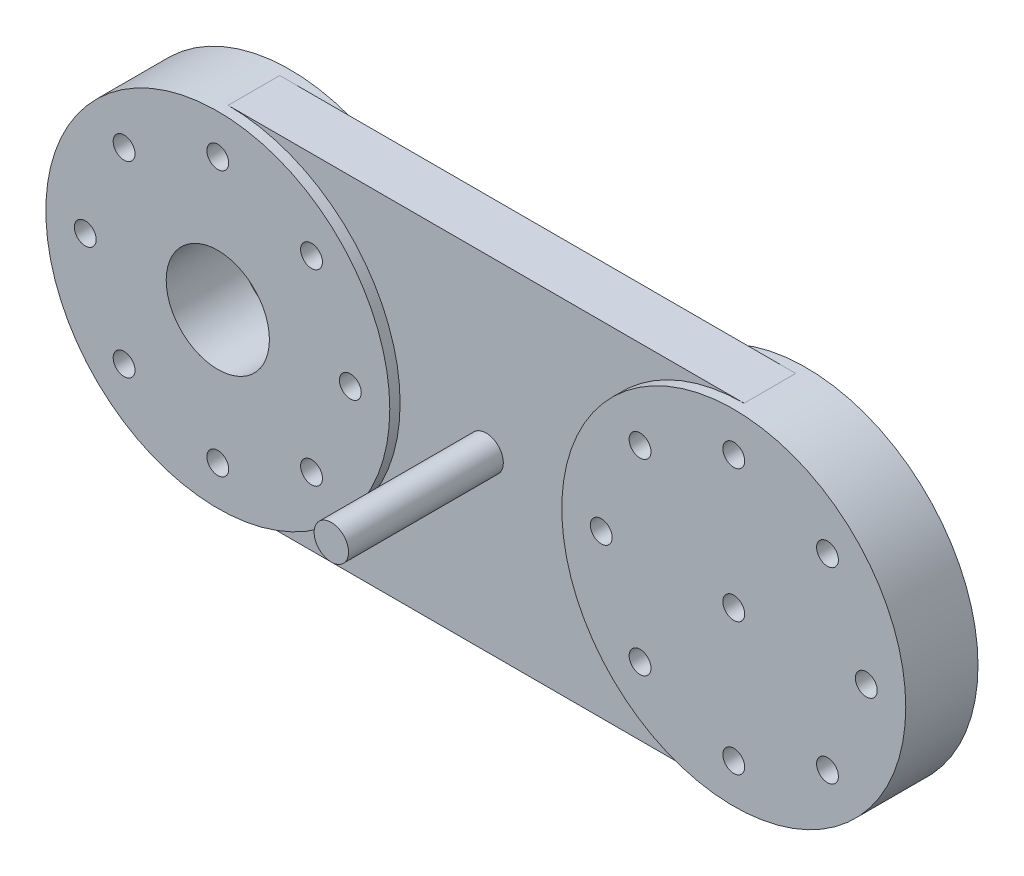
ISO-10303-21;
HEADER;
FILE_DESCRIPTION(('STEP AP214'),'2;1');
FILE_NAME('part.step','',(''),(''),'','','');
FILE_SCHEMA(('AUTOMOTIVE_DESIGN { 1 0 10303 214 1 1 1 1 }'));
ENDSEC;
DATA;
#1=APPLICATION_CONTEXT('core data for automotive mechanical design processes');
#2=APPLICATION_PROTOCOL_DEFINITION('international standard','automotive_design',2000,#1);
#3=PRODUCT_CONTEXT('',#1,'mechanical');
#4=PRODUCT('Part','Part','',(#3));
#5=PRODUCT_RELATED_PRODUCT_CATEGORY('part','',(#4));
#6=PRODUCT_DEFINITION_FORMATION('','',#4);
#7=PRODUCT_DEFINITION_CONTEXT('part definition',#1,'design');
#8=PRODUCT_DEFINITION('design','',#6,#7);
#9=PRODUCT_DEFINITION_SHAPE('','',#8);
#10=(LENGTH_UNIT() NAMED_UNIT(*) SI_UNIT(.MILLI.,.METRE.));
#11=(NAMED_UNIT(*) PLANE_ANGLE_UNIT() SI_UNIT($,.RADIAN.));
#12=(NAMED_UNIT(*) SI_UNIT($,.STERADIAN.) SOLID_ANGLE_UNIT());
#13=UNCERTAINTY_MEASURE_WITH_UNIT(LENGTH_MEASURE(1.E-05),#10,'distance_accuracy_value','');
#14=(GEOMETRIC_REPRESENTATION_CONTEXT(3) GLOBAL_UNCERTAINTY_ASSIGNED_CONTEXT((#13)) GLOBAL_UNIT_ASSIGNED_CONTEXT((#10,
#11,#12)) REPRESENTATION_CONTEXT('',''));
#15=CARTESIAN_POINT('',(0.,0.,0.));
#16=DIRECTION('',(0.,0.,1.));
#17=DIRECTION('',(1.,0.,0.));
#18=AXIS2_PLACEMENT_3D('',#15,#16,#17);
#19=CARTESIAN_POINT('',(0.,0.,-15.));
#20=DIRECTION('',(0.,1.,0.));
#21=DIRECTION('',(-1.,0.,0.));
#22=AXIS2_PLACEMENT_3D('',#19,#20,#21);
#23=PLANE('',#22);
#24=DIRECTION('',(-1.,0.,0.));
#25=VECTOR('',#24,1.);
#26=CARTESIAN_POINT('',(0.,0.,0.));
#27=LINE('',#26,#25);
#28=CARTESIAN_POINT('',(0.,0.,0.));
#29=VERTEX_POINT('',#28);
#30=CARTESIAN_POINT('',(-150.,0.,0.));
#31=VERTEX_POINT('',#30);
#32=EDGE_CURVE('E71',#29,#31,#27,.T.);
#33=ORIENTED_EDGE('',*,*,#32,.T.);
#34=DIRECTION('',(0.,0.,1.));
#35=VECTOR('',#34,1.);
#36=CARTESIAN_POINT('',(-150.,0.,-15.));
#37=LINE('',#36,#35);
#38=CARTESIAN_POINT('',(-150.,0.,-15.));
#39=VERTEX_POINT('',#38);
#40=EDGE_CURVE('E86',#39,#31,#37,.T.);
#41=ORIENTED_EDGE('',*,*,#40,.F.);
#42=DIRECTION('',(-1.,0.,0.));
#43=VECTOR('',#42,1.);
#44=CARTESIAN_POINT('',(0.,0.,-15.));
#45=LINE('',#44,#43);
#46=CARTESIAN_POINT('',(0.,0.,-15.));
#47=VERTEX_POINT('',#46);
#48=EDGE_CURVE('E83',#47,#39,#45,.T.);
#49=ORIENTED_EDGE('',*,*,#48,.F.);
#50=DIRECTION('',(0.,0.,1.));
#51=VECTOR('',#50,1.);
#52=CARTESIAN_POINT('',(0.,0.,-15.));
#53=LINE('',#52,#51);
#54=EDGE_CURVE('E44',#47,#29,#53,.T.);
#55=ORIENTED_EDGE('',*,*,#54,.T.);
#56=EDGE_LOOP('',(#33,#41,#49,#55));
#57=FACE_BOUND('',#56,.T.);
#58=ADVANCED_FACE('F36',(#57),#23,.F.);
#59=CARTESIAN_POINT('',(0.,100.,-15.));
#60=DIRECTION('',(0.,1.,0.));
#61=DIRECTION('',(-1.,0.,0.));
#62=AXIS2_PLACEMENT_3D('',#59,#60,#61);
#63=PLANE('',#62);
#64=DIRECTION('',(-1.,0.,0.));
#65=VECTOR('',#64,1.);
#66=CARTESIAN_POINT('',(0.,100.,0.));
#67=LINE('',#66,#65);
#68=CARTESIAN_POINT('',(0.,100.,0.));
#69=VERTEX_POINT('',#68);
#70=CARTESIAN_POINT('',(-150.,100.,0.));
#71=VERTEX_POINT('',#70);
#72=EDGE_CURVE('E79',#69,#71,#67,.T.);
#73=ORIENTED_EDGE('',*,*,#72,.F.);
#74=DIRECTION('',(0.,0.,1.));
#75=VECTOR('',#74,1.);
#76=CARTESIAN_POINT('',(0.,100.,-15.));
#77=LINE('',#76,#75);
#78=CARTESIAN_POINT('',(0.,100.,-15.));
#79=VERTEX_POINT('',#78);
#80=EDGE_CURVE('E90',#79,#69,#77,.T.);
#81=ORIENTED_EDGE('',*,*,#80,.F.);
#82=DIRECTION('',(-1.,0.,0.));
#83=VECTOR('',#82,1.);
#84=CARTESIAN_POINT('',(0.,100.,-15.));
#85=LINE('',#84,#83);
#86=CARTESIAN_POINT('',(-150.,100.,-15.));
#87=VERTEX_POINT('',#86);
#88=EDGE_CURVE('E78',#79,#87,#85,.T.);
#89=ORIENTED_EDGE('',*,*,#88,.T.);
#90=DIRECTION('',(0.,0.,1.));
#91=VECTOR('',#90,1.);
#92=CARTESIAN_POINT('',(-150.,100.,-15.));
#93=LINE('',#92,#91);
#94=EDGE_CURVE('E108',#87,#71,#93,.T.);
#95=ORIENTED_EDGE('',*,*,#94,.T.);
#96=EDGE_LOOP('',(#73,#81,#89,#95));
#97=FACE_BOUND('',#96,.T.);
#98=ADVANCED_FACE('F38',(#97),#63,.T.);
#99=CARTESIAN_POINT('',(0.,0.,-15.));
#100=DIRECTION('',(0.,0.,1.));
#101=DIRECTION('',(1.,0.,0.));
#102=AXIS2_PLACEMENT_3D('',#99,#100,#101);
#103=PLANE('',#102);
#104=ORIENTED_EDGE('',*,*,#48,.T.);
#105=CARTESIAN_POINT('',(-150.,50.,-15.));
#106=DIRECTION('',(0.,0.,1.));
#107=DIRECTION('',(1.,0.,0.));
#108=AXIS2_PLACEMENT_3D('',#105,#106,#107);
#109=CIRCLE('',#108,50.);
#110=EDGE_CURVE('E92',#39,#87,#109,.T.);
#111=ORIENTED_EDGE('',*,*,#110,.T.);
#112=ORIENTED_EDGE('',*,*,#88,.F.);
#113=CARTESIAN_POINT('',(0.,50.,-15.));
#114=DIRECTION('',(0.,0.,1.));
#115=DIRECTION('',(1.,0.,0.));
#116=AXIS2_PLACEMENT_3D('',#113,#114,#115);
#117=CIRCLE('',#116,50.);
#118=EDGE_CURVE('E97',#79,#47,#117,.T.);
#119=ORIENTED_EDGE('',*,*,#118,.T.);
#120=EDGE_LOOP('',(#104,#111,#112,#119));
#121=FACE_BOUND('',#120,.T.);
#122=ADVANCED_FACE('F117',(#121),#103,.F.);
#123=CARTESIAN_POINT('',(0.,0.,0.));
#124=DIRECTION('',(0.,0.,1.));
#125=DIRECTION('',(1.,0.,0.));
#126=AXIS2_PLACEMENT_3D('',#123,#124,#125);
#127=PLANE('',#126);
#128=CARTESIAN_POINT('',(-150.,50.,0.));
#129=DIRECTION('',(0.,0.,1.));
#130=DIRECTION('',(1.,0.,0.));
#131=AXIS2_PLACEMENT_3D('',#128,#129,#130);
#132=CIRCLE('',#131,50.);
#133=EDGE_CURVE('E11',#31,#71,#132,.T.);
#134=ORIENTED_EDGE('',*,*,#133,.F.);
#135=ORIENTED_EDGE('',*,*,#32,.F.);
#136=CARTESIAN_POINT('',(0.,50.,0.));
#137=DIRECTION('',(0.,0.,1.));
#138=DIRECTION('',(1.,0.,0.));
#139=AXIS2_PLACEMENT_3D('',#136,#137,#138);
#140=CIRCLE('',#139,50.);
#141=EDGE_CURVE('E54',#69,#29,#140,.T.);
#142=ORIENTED_EDGE('',*,*,#141,.F.);
#143=ORIENTED_EDGE('',*,*,#72,.T.);
#144=EDGE_LOOP('',(#134,#135,#142,#143));
#145=FACE_BOUND('',#144,.T.);
#146=CARTESIAN_POINT('',(-75.,50.,0.));
#147=DIRECTION('',(0.,0.,1.));
#148=DIRECTION('',(1.,0.,0.));
#149=AXIS2_PLACEMENT_3D('',#146,#147,#148);
#150=CIRCLE('',#149,5.00000000000001);
#151=CARTESIAN_POINT('',(-70.,50.,0.));
#152=VERTEX_POINT('',#151);
#153=EDGE_CURVE('E91',#152,#152,#150,.T.);
#154=ORIENTED_EDGE('',*,*,#153,.F.);
#155=EDGE_LOOP('',(#154));
#156=FACE_BOUND('',#155,.T.);
#157=ADVANCED_FACE('F73',(#145,#156),#127,.T.);
#158=CARTESIAN_POINT('',(-75.,50.,45.));
#159=DIRECTION('',(0.,0.,-1.));
#160=DIRECTION('',(-1.,0.,0.));
#161=AXIS2_PLACEMENT_3D('',#158,#159,#160);
#162=CYLINDRICAL_SURFACE('',#161,5.00000000000001);
#163=CARTESIAN_POINT('',(-75.,50.,45.));
#164=DIRECTION('',(0.,0.,1.));
#165=DIRECTION('',(1.,0.,0.));
#166=AXIS2_PLACEMENT_3D('',#163,#164,#165);
#167=CIRCLE('',#166,5.00000000000001);
#168=CARTESIAN_POINT('',(-70.,50.,45.));
#169=VERTEX_POINT('',#168);
#170=EDGE_CURVE('E95',#169,#169,#167,.T.);
#171=ORIENTED_EDGE('',*,*,#170,.F.);
#172=EDGE_LOOP('',(#171));
#173=FACE_BOUND('',#172,.T.);
#174=ORIENTED_EDGE('',*,*,#153,.T.);
#175=EDGE_LOOP('',(#174));
#176=FACE_BOUND('',#175,.T.);
#177=ADVANCED_FACE('F287',(#173,#176),#162,.T.);
#178=CARTESIAN_POINT('',(-75.,50.,45.));
#179=DIRECTION('',(0.,0.,1.));
#180=DIRECTION('',(1.,0.,0.));
#181=AXIS2_PLACEMENT_3D('',#178,#179,#180);
#182=PLANE('',#181);
#183=ORIENTED_EDGE('',*,*,#170,.T.);
#184=EDGE_LOOP('',(#183));
#185=FACE_BOUND('',#184,.T.);
#186=ADVANCED_FACE('F292',(#185),#182,.T.);
#187=CARTESIAN_POINT('',(-150.,50.,3.));
#188=DIRECTION('',(0.,0.,-1.));
#189=DIRECTION('',(-1.,0.,0.));
#190=AXIS2_PLACEMENT_3D('',#187,#188,#189);
#191=CYLINDRICAL_SURFACE('',#190,50.);
#192=CARTESIAN_POINT('',(-150.,50.,3.));
#193=DIRECTION('',(0.,0.,1.));
#194=DIRECTION('',(1.,0.,0.));
#195=AXIS2_PLACEMENT_3D('',#192,#193,#194);
#196=CIRCLE('',#195,50.);
#197=CARTESIAN_POINT('',(-100.,50.,3.));
#198=VERTEX_POINT('',#197);
#199=EDGE_CURVE('E143',#198,#198,#196,.T.);
#200=ORIENTED_EDGE('',*,*,#199,.F.);
#201=EDGE_LOOP('',(#200));
#202=FACE_BOUND('',#201,.T.);
#203=CARTESIAN_POINT('',(-150.,50.,-17.9999999999999));
#204=DIRECTION('',(0.,0.,1.));
#205=DIRECTION('',(1.,0.,0.));
#206=AXIS2_PLACEMENT_3D('',#203,#204,#205);
#207=CIRCLE('',#206,50.);
#208=CARTESIAN_POINT('',(-100.,50.,-17.9999999999999));
#209=VERTEX_POINT('',#208);
#210=EDGE_CURVE('E170',#209,#209,#207,.T.);
#211=ORIENTED_EDGE('',*,*,#210,.T.);
#212=EDGE_LOOP('',(#211));
#213=FACE_BOUND('',#212,.T.);
#214=ORIENTED_EDGE('',*,*,#94,.F.);
#215=ORIENTED_EDGE('',*,*,#110,.F.);
#216=ORIENTED_EDGE('',*,*,#40,.T.);
#217=ORIENTED_EDGE('',*,*,#133,.T.);
#218=EDGE_LOOP('',(#214,#215,#216,#217));
#219=FACE_BOUND('',#218,.T.);
#220=ADVANCED_FACE('F115',(#202,#213,#219),#191,.T.);
#221=CARTESIAN_POINT('',(-122.754935969732,22.7549359697323,3.));
#222=DIRECTION('',(0.,0.,-1.));
#223=DIRECTION('',(-1.,0.,0.));
#224=AXIS2_PLACEMENT_3D('',#221,#222,#223);
#225=CYLINDRICAL_SURFACE('',#224,3.175);
#226=CARTESIAN_POINT('',(-122.754935969732,22.7549359697323,3.));
#227=DIRECTION('',(0.,0.,1.));
#228=DIRECTION('',(1.,0.,0.));
#229=AXIS2_PLACEMENT_3D('',#226,#227,#228);
#230=CIRCLE('',#229,3.175);
#231=CARTESIAN_POINT('',(-119.579935969732,22.7549359697323,3.));
#232=VERTEX_POINT('',#231);
#233=EDGE_CURVE('E120',#232,#232,#230,.T.);
#234=ORIENTED_EDGE('',*,*,#233,.T.);
#235=EDGE_LOOP('',(#234));
#236=FACE_BOUND('',#235,.T.);
#237=CARTESIAN_POINT('',(-122.754935969732,22.7549359697323,-17.9999999999999));
#238=DIRECTION('',(0.,0.,1.));
#239=DIRECTION('',(1.,0.,0.));
#240=AXIS2_PLACEMENT_3D('',#237,#238,#239);
#241=CIRCLE('',#240,3.175);
#242=CARTESIAN_POINT('',(-119.579935969732,22.7549359697323,-17.9999999999999));
#243=VERTEX_POINT('',#242);
#244=EDGE_CURVE('E149',#243,#243,#241,.T.);
#245=ORIENTED_EDGE('',*,*,#244,.F.);
#246=EDGE_LOOP('',(#245));
#247=FACE_BOUND('',#246,.T.);
#248=ADVANCED_FACE('F298',(#236,#247),#225,.F.);
#249=CARTESIAN_POINT('',(-122.754935969734,77.2450640302665,3.));
#250=DIRECTION('',(0.,0.,-1.));
#251=DIRECTION('',(-1.,0.,0.));
#252=AXIS2_PLACEMENT_3D('',#249,#250,#251);
#253=CYLINDRICAL_SURFACE('',#252,3.175);
#254=CARTESIAN_POINT('',(-122.754935969734,77.2450640302665,3.));
#255=DIRECTION('',(0.,0.,1.));
#256=DIRECTION('',(1.,0.,0.));
#257=AXIS2_PLACEMENT_3D('',#254,#255,#256);
#258=CIRCLE('',#257,3.175);
#259=CARTESIAN_POINT('',(-119.579935969734,77.2450640302665,3.));
#260=VERTEX_POINT('',#259);
#261=EDGE_CURVE('E125',#260,#260,#258,.T.);
#262=ORIENTED_EDGE('',*,*,#261,.T.);
#263=EDGE_LOOP('',(#262));
#264=FACE_BOUND('',#263,.T.);
#265=CARTESIAN_POINT('',(-122.754935969734,77.2450640302665,-17.9999999999999));
#266=DIRECTION('',(0.,0.,1.));
#267=DIRECTION('',(1.,0.,0.));
#268=AXIS2_PLACEMENT_3D('',#265,#266,#267);
#269=CIRCLE('',#268,3.175);
#270=CARTESIAN_POINT('',(-119.579935969734,77.2450640302665,-17.9999999999999));
#271=VERTEX_POINT('',#270);
#272=EDGE_CURVE('E152',#271,#271,#269,.T.);
#273=ORIENTED_EDGE('',*,*,#272,.F.);
#274=EDGE_LOOP('',(#273));
#275=FACE_BOUND('',#274,.T.);
#276=ADVANCED_FACE('F315',(#264,#275),#253,.F.);
#277=CARTESIAN_POINT('',(-111.469660940673,50.0000000000001,3.));
#278=DIRECTION('',(0.,0.,-1.));
#279=DIRECTION('',(-1.,0.,0.));
#280=AXIS2_PLACEMENT_3D('',#277,#278,#279);
#281=CYLINDRICAL_SURFACE('',#280,3.175);
#282=CARTESIAN_POINT('',(-111.469660940673,50.0000000000001,3.));
#283=DIRECTION('',(0.,0.,1.));
#284=DIRECTION('',(1.,0.,0.));
#285=AXIS2_PLACEMENT_3D('',#282,#283,#284);
#286=CIRCLE('',#285,3.175);
#287=CARTESIAN_POINT('',(-108.294660940673,50.0000000000001,3.));
#288=VERTEX_POINT('',#287);
#289=EDGE_CURVE('E128',#288,#288,#286,.T.);
#290=ORIENTED_EDGE('',*,*,#289,.T.);
#291=EDGE_LOOP('',(#290));
#292=FACE_BOUND('',#291,.T.);
#293=CARTESIAN_POINT('',(-111.469660940673,50.0000000000001,-17.9999999999999));
#294=DIRECTION('',(0.,0.,1.));
#295=DIRECTION('',(1.,0.,0.));
#296=AXIS2_PLACEMENT_3D('',#293,#294,#295);
#297=CIRCLE('',#296,3.175);
#298=CARTESIAN_POINT('',(-108.294660940673,50.0000000000001,-17.9999999999999));
#299=VERTEX_POINT('',#298);
#300=EDGE_CURVE('E155',#299,#299,#297,.T.);
#301=ORIENTED_EDGE('',*,*,#300,.F.);
#302=EDGE_LOOP('',(#301));
#303=FACE_BOUND('',#302,.T.);
#304=ADVANCED_FACE('F311',(#292,#303),#281,.F.);
#305=CARTESIAN_POINT('',(-150.000000000001,88.5303390593257,3.));
#306=DIRECTION('',(0.,0.,-1.));
#307=DIRECTION('',(-1.,0.,0.));
#308=AXIS2_PLACEMENT_3D('',#305,#306,#307);
#309=CYLINDRICAL_SURFACE('',#308,3.17499999999999);
#310=CARTESIAN_POINT('',(-150.000000000001,88.5303390593257,3.));
#311=DIRECTION('',(0.,0.,1.));
#312=DIRECTION('',(1.,0.,0.));
#313=AXIS2_PLACEMENT_3D('',#310,#311,#312);
#314=CIRCLE('',#313,3.17499999999999);
#315=CARTESIAN_POINT('',(-146.825000000001,88.5303390593257,3.));
#316=VERTEX_POINT('',#315);
#317=EDGE_CURVE('E131',#316,#316,#314,.T.);
#318=ORIENTED_EDGE('',*,*,#317,.T.);
#319=EDGE_LOOP('',(#318));
#320=FACE_BOUND('',#319,.T.);
#321=CARTESIAN_POINT('',(-150.000000000001,88.5303390593257,-17.9999999999999));
#322=DIRECTION('',(0.,0.,1.));
#323=DIRECTION('',(1.,0.,0.));
#324=AXIS2_PLACEMENT_3D('',#321,#322,#323);
#325=CIRCLE('',#324,3.17499999999999);
#326=CARTESIAN_POINT('',(-146.825000000001,88.5303390593257,-17.9999999999999));
#327=VERTEX_POINT('',#326);
#328=EDGE_CURVE('E158',#327,#327,#325,.T.);
#329=ORIENTED_EDGE('',*,*,#328,.F.);
#330=EDGE_LOOP('',(#329));
#331=FACE_BOUND('',#330,.T.);
#332=ADVANCED_FACE('F307',(#320,#331),#309,.F.);
#333=CARTESIAN_POINT('',(-188.530339059327,49.9999999999969,3.));
#334=DIRECTION('',(0.,0.,-1.));
#335=DIRECTION('',(-1.,0.,0.));
#336=AXIS2_PLACEMENT_3D('',#333,#334,#335);
#337=CYLINDRICAL_SURFACE('',#336,3.17500000000002);
#338=CARTESIAN_POINT('',(-188.530339059327,49.9999999999969,3.));
#339=DIRECTION('',(0.,0.,1.));
#340=DIRECTION('',(1.,0.,0.));
#341=AXIS2_PLACEMENT_3D('',#338,#339,#340);
#342=CIRCLE('',#341,3.17500000000002);
#343=CARTESIAN_POINT('',(-185.355339059327,49.9999999999969,3.));
#344=VERTEX_POINT('',#343);
#345=EDGE_CURVE('E134',#344,#344,#342,.T.);
#346=ORIENTED_EDGE('',*,*,#345,.T.);
#347=EDGE_LOOP('',(#346));
#348=FACE_BOUND('',#347,.T.);
#349=CARTESIAN_POINT('',(-188.530339059327,49.9999999999969,-17.9999999999999));
#350=DIRECTION('',(0.,0.,1.));
#351=DIRECTION('',(1.,0.,0.));
#352=AXIS2_PLACEMENT_3D('',#349,#350,#351);
#353=CIRCLE('',#352,3.17500000000002);
#354=CARTESIAN_POINT('',(-185.355339059327,49.9999999999969,-17.9999999999999));
#355=VERTEX_POINT('',#354);
#356=EDGE_CURVE('E161',#355,#355,#353,.T.);
#357=ORIENTED_EDGE('',*,*,#356,.F.);
#358=EDGE_LOOP('',(#357));
#359=FACE_BOUND('',#358,.T.);
#360=ADVANCED_FACE('F303',(#348,#359),#337,.F.);
#361=CARTESIAN_POINT('',(-177.245064030266,22.7549359697301,3.));
#362=DIRECTION('',(0.,0.,-1.));
#363=DIRECTION('',(-1.,0.,0.));
#364=AXIS2_PLACEMENT_3D('',#361,#362,#363);
#365=CYLINDRICAL_SURFACE('',#364,3.17500000000001);
#366=CARTESIAN_POINT('',(-177.245064030266,22.7549359697301,3.));
#367=DIRECTION('',(0.,0.,1.));
#368=DIRECTION('',(1.,0.,0.));
#369=AXIS2_PLACEMENT_3D('',#366,#367,#368);
#370=CIRCLE('',#369,3.17500000000001);
#371=CARTESIAN_POINT('',(-174.070064030266,22.7549359697301,3.));
#372=VERTEX_POINT('',#371);
#373=EDGE_CURVE('E137',#372,#372,#370,.T.);
#374=ORIENTED_EDGE('',*,*,#373,.T.);
#375=EDGE_LOOP('',(#374));
#376=FACE_BOUND('',#375,.T.);
#377=CARTESIAN_POINT('',(-177.245064030266,22.7549359697301,-17.9999999999999));
#378=DIRECTION('',(0.,0.,1.));
#379=DIRECTION('',(1.,0.,0.));
#380=AXIS2_PLACEMENT_3D('',#377,#378,#379);
#381=CIRCLE('',#380,3.17500000000001);
#382=CARTESIAN_POINT('',(-174.070064030266,22.7549359697301,-17.9999999999999));
#383=VERTEX_POINT('',#382);
#384=EDGE_CURVE('E164',#383,#383,#381,.T.);
#385=ORIENTED_EDGE('',*,*,#384,.F.);
#386=EDGE_LOOP('',(#385));
#387=FACE_BOUND('',#386,.T.);
#388=ADVANCED_FACE('F276',(#376,#387),#365,.F.);
#389=CARTESIAN_POINT('',(-149.999999999998,11.469660940671,3.));
#390=DIRECTION('',(0.,0.,-1.));
#391=DIRECTION('',(-1.,0.,0.));
#392=AXIS2_PLACEMENT_3D('',#389,#390,#391);
#393=CYLINDRICAL_SURFACE('',#392,3.175);
#394=CARTESIAN_POINT('',(-149.999999999998,11.469660940671,3.));
#395=DIRECTION('',(0.,0.,1.));
#396=DIRECTION('',(1.,0.,0.));
#397=AXIS2_PLACEMENT_3D('',#394,#395,#396);
#398=CIRCLE('',#397,3.175);
#399=CARTESIAN_POINT('',(-146.824999999998,11.469660940671,3.));
#400=VERTEX_POINT('',#399);
#401=EDGE_CURVE('E140',#400,#400,#398,.T.);
#402=ORIENTED_EDGE('',*,*,#401,.T.);
#403=EDGE_LOOP('',(#402));
#404=FACE_BOUND('',#403,.T.);
#405=CARTESIAN_POINT('',(-149.999999999998,11.469660940671,-17.9999999999999));
#406=DIRECTION('',(0.,0.,1.));
#407=DIRECTION('',(1.,0.,0.));
#408=AXIS2_PLACEMENT_3D('',#405,#406,#407);
#409=CIRCLE('',#408,3.175);
#410=CARTESIAN_POINT('',(-146.824999999998,11.469660940671,-17.9999999999999));
#411=VERTEX_POINT('',#410);
#412=EDGE_CURVE('E167',#411,#411,#409,.T.);
#413=ORIENTED_EDGE('',*,*,#412,.F.);
#414=EDGE_LOOP('',(#413));
#415=FACE_BOUND('',#414,.T.);
#416=ADVANCED_FACE('F267',(#404,#415),#393,.F.);
#417=CARTESIAN_POINT('',(-177.245064030268,77.2450640302647,3.));
#418=DIRECTION('',(0.,0.,-1.));
#419=DIRECTION('',(-1.,0.,0.));
#420=AXIS2_PLACEMENT_3D('',#417,#418,#419);
#421=CYLINDRICAL_SURFACE('',#420,3.175);
#422=CARTESIAN_POINT('',(-177.245064030268,77.2450640302647,3.));
#423=DIRECTION('',(0.,0.,1.));
#424=DIRECTION('',(1.,0.,0.));
#425=AXIS2_PLACEMENT_3D('',#422,#423,#424);
#426=CIRCLE('',#425,3.175);
#427=CARTESIAN_POINT('',(-174.070064030268,77.2450640302647,3.));
#428=VERTEX_POINT('',#427);
#429=EDGE_CURVE('E118',#428,#428,#426,.T.);
#430=ORIENTED_EDGE('',*,*,#429,.T.);
#431=EDGE_LOOP('',(#430));
#432=FACE_BOUND('',#431,.T.);
#433=CARTESIAN_POINT('',(-177.245064030268,77.2450640302647,-17.9999999999999));
#434=DIRECTION('',(0.,0.,1.));
#435=DIRECTION('',(1.,0.,0.));
#436=AXIS2_PLACEMENT_3D('',#433,#434,#435);
#437=CIRCLE('',#436,3.175);
#438=CARTESIAN_POINT('',(-174.070064030268,77.2450640302647,-17.9999999999999));
#439=VERTEX_POINT('',#438);
#440=EDGE_CURVE('E146',#439,#439,#437,.T.);
#441=ORIENTED_EDGE('',*,*,#440,.F.);
#442=EDGE_LOOP('',(#441));
#443=FACE_BOUND('',#442,.T.);
#444=ADVANCED_FACE('F265',(#432,#443),#421,.F.);
#445=CARTESIAN_POINT('',(0.,0.,3.));
#446=DIRECTION('',(0.,0.,1.));
#447=DIRECTION('',(1.,0.,0.));
#448=AXIS2_PLACEMENT_3D('',#445,#446,#447);
#449=PLANE('',#448);
#450=CARTESIAN_POINT('',(-150.,50.,3.));
#451=DIRECTION('',(0.,0.,1.));
#452=DIRECTION('',(1.,0.,0.));
#453=AXIS2_PLACEMENT_3D('',#450,#451,#452);
#454=CIRCLE('',#453,15.);
#455=CARTESIAN_POINT('',(-135.,50.,3.));
#456=VERTEX_POINT('',#455);
#457=EDGE_CURVE('E233',#456,#456,#454,.T.);
#458=ORIENTED_EDGE('',*,*,#457,.F.);
#459=EDGE_LOOP('',(#458));
#460=FACE_BOUND('',#459,.T.);
#461=ORIENTED_EDGE('',*,*,#199,.T.);
#462=EDGE_LOOP('',(#461));
#463=FACE_BOUND('',#462,.T.);
#464=ORIENTED_EDGE('',*,*,#401,.F.);
#465=EDGE_LOOP('',(#464));
#466=FACE_BOUND('',#465,.T.);
#467=ORIENTED_EDGE('',*,*,#373,.F.);
#468=EDGE_LOOP('',(#467));
#469=FACE_BOUND('',#468,.T.);
#470=ORIENTED_EDGE('',*,*,#345,.F.);
#471=EDGE_LOOP('',(#470));
#472=FACE_BOUND('',#471,.T.);
#473=ORIENTED_EDGE('',*,*,#317,.F.);
#474=EDGE_LOOP('',(#473));
#475=FACE_BOUND('',#474,.T.);
#476=ORIENTED_EDGE('',*,*,#289,.F.);
#477=EDGE_LOOP('',(#476));
#478=FACE_BOUND('',#477,.T.);
#479=ORIENTED_EDGE('',*,*,#261,.F.);
#480=EDGE_LOOP('',(#479));
#481=FACE_BOUND('',#480,.T.);
#482=ORIENTED_EDGE('',*,*,#233,.F.);
#483=EDGE_LOOP('',(#482));
#484=FACE_BOUND('',#483,.T.);
#485=ORIENTED_EDGE('',*,*,#429,.F.);
#486=EDGE_LOOP('',(#485));
#487=FACE_BOUND('',#486,.T.);
#488=ADVANCED_FACE('F245',(#460,#463,#466,#469,#472,#475,#478,#481,#484,#487),#449,.T.);
#489=CARTESIAN_POINT('',(0.,0.,-17.9999999999999));
#490=DIRECTION('',(0.,0.,1.));
#491=DIRECTION('',(1.,0.,0.));
#492=AXIS2_PLACEMENT_3D('',#489,#490,#491);
#493=PLANE('',#492);
#494=CARTESIAN_POINT('',(-150.,50.,-17.9999999999999));
#495=DIRECTION('',(0.,0.,-1.));
#496=DIRECTION('',(-1.,0.,0.));
#497=AXIS2_PLACEMENT_3D('',#494,#495,#496);
#498=CIRCLE('',#497,15.);
#499=CARTESIAN_POINT('',(-165.,50.,-17.9999999999999));
#500=VERTEX_POINT('',#499);
#501=EDGE_CURVE('E236',#500,#500,#498,.T.);
#502=ORIENTED_EDGE('',*,*,#501,.F.);
#503=EDGE_LOOP('',(#502));
#504=FACE_BOUND('',#503,.T.);
#505=ORIENTED_EDGE('',*,*,#210,.F.);
#506=EDGE_LOOP('',(#505));
#507=FACE_BOUND('',#506,.T.);
#508=ORIENTED_EDGE('',*,*,#412,.T.);
#509=EDGE_LOOP('',(#508));
#510=FACE_BOUND('',#509,.T.);
#511=ORIENTED_EDGE('',*,*,#384,.T.);
#512=EDGE_LOOP('',(#511));
#513=FACE_BOUND('',#512,.T.);
#514=ORIENTED_EDGE('',*,*,#356,.T.);
#515=EDGE_LOOP('',(#514));
#516=FACE_BOUND('',#515,.T.);
#517=ORIENTED_EDGE('',*,*,#328,.T.);
#518=EDGE_LOOP('',(#517));
#519=FACE_BOUND('',#518,.T.);
#520=ORIENTED_EDGE('',*,*,#300,.T.);
#521=EDGE_LOOP('',(#520));
#522=FACE_BOUND('',#521,.T.);
#523=ORIENTED_EDGE('',*,*,#272,.T.);
#524=EDGE_LOOP('',(#523));
#525=FACE_BOUND('',#524,.T.);
#526=ORIENTED_EDGE('',*,*,#244,.T.);
#527=EDGE_LOOP('',(#526));
#528=FACE_BOUND('',#527,.T.);
#529=ORIENTED_EDGE('',*,*,#440,.T.);
#530=EDGE_LOOP('',(#529));
#531=FACE_BOUND('',#530,.T.);
#532=ADVANCED_FACE('F242',(#504,#507,#510,#513,#516,#519,#522,#525,#528,#531),#493,.F.);
#533=CARTESIAN_POINT('',(0.,50.,3.));
#534=DIRECTION('',(0.,0.,-1.));
#535=DIRECTION('',(-1.,0.,0.));
#536=AXIS2_PLACEMENT_3D('',#533,#534,#535);
#537=CYLINDRICAL_SURFACE('',#536,50.);
#538=CARTESIAN_POINT('',(0.,50.,3.));
#539=DIRECTION('',(0.,0.,1.));
#540=DIRECTION('',(1.,0.,0.));
#541=AXIS2_PLACEMENT_3D('',#538,#539,#540);
#542=CIRCLE('',#541,50.);
#543=CARTESIAN_POINT('',(50.,50.,3.));
#544=VERTEX_POINT('',#543);
#545=EDGE_CURVE('E197',#544,#544,#542,.T.);
#546=ORIENTED_EDGE('',*,*,#545,.F.);
#547=EDGE_LOOP('',(#546));
#548=FACE_BOUND('',#547,.T.);
#549=CARTESIAN_POINT('',(0.,50.,-17.9999999999999));
#550=DIRECTION('',(0.,0.,1.));
#551=DIRECTION('',(1.,0.,0.));
#552=AXIS2_PLACEMENT_3D('',#549,#550,#551);
#553=CIRCLE('',#552,50.);
#554=CARTESIAN_POINT('',(50.,50.,-17.9999999999999));
#555=VERTEX_POINT('',#554);
#556=EDGE_CURVE('E227',#555,#555,#553,.T.);
#557=ORIENTED_EDGE('',*,*,#556,.T.);
#558=EDGE_LOOP('',(#557));
#559=FACE_BOUND('',#558,.T.);
#560=ORIENTED_EDGE('',*,*,#54,.F.);
#561=ORIENTED_EDGE('',*,*,#118,.F.);
#562=ORIENTED_EDGE('',*,*,#80,.T.);
#563=ORIENTED_EDGE('',*,*,#141,.T.);
#564=EDGE_LOOP('',(#560,#561,#562,#563));
#565=FACE_BOUND('',#564,.T.);
#566=ADVANCED_FACE('F89',(#548,#559,#565),#537,.T.);
#567=CARTESIAN_POINT('',(27.2450640302644,22.75493596973,3.));
#568=DIRECTION('',(0.,0.,-1.));
#569=DIRECTION('',(-1.,0.,0.));
#570=AXIS2_PLACEMENT_3D('',#567,#568,#569);
#571=CYLINDRICAL_SURFACE('',#570,3.17500000000004);
#572=CARTESIAN_POINT('',(27.2450640302644,22.75493596973,3.));
#573=DIRECTION('',(0.,0.,1.));
#574=DIRECTION('',(1.,0.,0.));
#575=AXIS2_PLACEMENT_3D('',#572,#573,#574);
#576=CIRCLE('',#575,3.17500000000004);
#577=CARTESIAN_POINT('',(30.4200640302644,22.75493596973,3.));
#578=VERTEX_POINT('',#577);
#579=EDGE_CURVE('E176',#578,#578,#576,.T.);
#580=ORIENTED_EDGE('',*,*,#579,.T.);
#581=EDGE_LOOP('',(#580));
#582=FACE_BOUND('',#581,.T.);
#583=CARTESIAN_POINT('',(27.2450640302644,22.75493596973,-17.9999999999999));
#584=DIRECTION('',(0.,0.,1.));
#585=DIRECTION('',(1.,0.,0.));
#586=AXIS2_PLACEMENT_3D('',#583,#584,#585);
#587=CIRCLE('',#586,3.17500000000004);
#588=CARTESIAN_POINT('',(30.4200640302644,22.75493596973,-17.9999999999999));
#589=VERTEX_POINT('',#588);
#590=EDGE_CURVE('E206',#589,#589,#587,.T.);
#591=ORIENTED_EDGE('',*,*,#590,.F.);
#592=EDGE_LOOP('',(#591));
#593=FACE_BOUND('',#592,.T.);
#594=ADVANCED_FACE('F368',(#582,#593),#571,.F.);
#595=CARTESIAN_POINT('',(27.2450640302702,77.2450640302641,3.));
#596=DIRECTION('',(0.,0.,-1.));
#597=DIRECTION('',(-1.,0.,0.));
#598=AXIS2_PLACEMENT_3D('',#595,#596,#597);
#599=CYLINDRICAL_SURFACE('',#598,3.17500000000004);
#600=CARTESIAN_POINT('',(27.2450640302702,77.2450640302641,3.));
#601=DIRECTION('',(0.,0.,1.));
#602=DIRECTION('',(1.,0.,0.));
#603=AXIS2_PLACEMENT_3D('',#600,#601,#602);
#604=CIRCLE('',#603,3.17500000000004);
#605=CARTESIAN_POINT('',(30.4200640302703,77.2450640302641,3.));
#606=VERTEX_POINT('',#605);
#607=EDGE_CURVE('E179',#606,#606,#604,.T.);
#608=ORIENTED_EDGE('',*,*,#607,.T.);
#609=EDGE_LOOP('',(#608));
#610=FACE_BOUND('',#609,.T.);
#611=CARTESIAN_POINT('',(27.2450640302702,77.2450640302641,-17.9999999999999));
#612=DIRECTION('',(0.,0.,1.));
#613=DIRECTION('',(1.,0.,0.));
#614=AXIS2_PLACEMENT_3D('',#611,#612,#613);
#615=CIRCLE('',#614,3.17500000000004);
#616=CARTESIAN_POINT('',(30.4200640302703,77.2450640302641,-17.9999999999999));
#617=VERTEX_POINT('',#616);
#618=EDGE_CURVE('E209',#617,#617,#615,.T.);
#619=ORIENTED_EDGE('',*,*,#618,.F.);
#620=EDGE_LOOP('',(#619));
#621=FACE_BOUND('',#620,.T.);
#622=ADVANCED_FACE('F379',(#610,#621),#599,.F.);
#623=CARTESIAN_POINT('',(-27.2450640302642,77.2450640302701,3.));
#624=DIRECTION('',(0.,0.,-1.));
#625=DIRECTION('',(-1.,0.,0.));
#626=AXIS2_PLACEMENT_3D('',#623,#624,#625);
#627=CYLINDRICAL_SURFACE('',#626,3.17500000000005);
#628=CARTESIAN_POINT('',(-27.2450640302642,77.2450640302701,3.));
#629=DIRECTION('',(0.,0.,1.));
#630=DIRECTION('',(1.,0.,0.));
#631=AXIS2_PLACEMENT_3D('',#628,#629,#630);
#632=CIRCLE('',#631,3.17500000000005);
#633=CARTESIAN_POINT('',(-24.0700640302641,77.2450640302701,3.));
#634=VERTEX_POINT('',#633);
#635=EDGE_CURVE('E182',#634,#634,#632,.T.);
#636=ORIENTED_EDGE('',*,*,#635,.T.);
#637=EDGE_LOOP('',(#636));
#638=FACE_BOUND('',#637,.T.);
#639=CARTESIAN_POINT('',(-27.2450640302642,77.2450640302701,-17.9999999999999));
#640=DIRECTION('',(0.,0.,1.));
#641=DIRECTION('',(1.,0.,0.));
#642=AXIS2_PLACEMENT_3D('',#639,#640,#641);
#643=CIRCLE('',#642,3.17500000000005);
#644=CARTESIAN_POINT('',(-24.0700640302641,77.2450640302701,-17.9999999999999));
#645=VERTEX_POINT('',#644);
#646=EDGE_CURVE('E212',#645,#645,#643,.T.);
#647=ORIENTED_EDGE('',*,*,#646,.F.);
#648=EDGE_LOOP('',(#647));
#649=FACE_BOUND('',#648,.T.);
#650=ADVANCED_FACE('F389',(#638,#649),#627,.F.);
#651=CARTESIAN_POINT('',(-27.24506403027,22.7549359697357,3.));
#652=DIRECTION('',(0.,0.,-1.));
#653=DIRECTION('',(-1.,0.,0.));
#654=AXIS2_PLACEMENT_3D('',#651,#652,#653);
#655=CYLINDRICAL_SURFACE('',#654,3.17500000000004);
#656=CARTESIAN_POINT('',(-27.24506403027,22.7549359697357,3.));
#657=DIRECTION('',(0.,0.,1.));
#658=DIRECTION('',(1.,0.,0.));
#659=AXIS2_PLACEMENT_3D('',#656,#657,#658);
#660=CIRCLE('',#659,3.17500000000004);
#661=CARTESIAN_POINT('',(-24.07006403027,22.7549359697357,3.));
#662=VERTEX_POINT('',#661);
#663=EDGE_CURVE('E185',#662,#662,#660,.T.);
#664=ORIENTED_EDGE('',*,*,#663,.T.);
#665=EDGE_LOOP('',(#664));
#666=FACE_BOUND('',#665,.T.);
#667=CARTESIAN_POINT('',(-27.24506403027,22.7549359697357,-17.9999999999999));
#668=DIRECTION('',(0.,0.,1.));
#669=DIRECTION('',(1.,0.,0.));
#670=AXIS2_PLACEMENT_3D('',#667,#668,#669);
#671=CIRCLE('',#670,3.17500000000004);
#672=CARTESIAN_POINT('',(-24.07006403027,22.7549359697357,-17.9999999999999));
#673=VERTEX_POINT('',#672);
#674=EDGE_CURVE('E215',#673,#673,#671,.T.);
#675=ORIENTED_EDGE('',*,*,#674,.F.);
#676=EDGE_LOOP('',(#675));
#677=FACE_BOUND('',#676,.T.);
#678=ADVANCED_FACE('F399',(#666,#677),#655,.F.);
#679=CARTESIAN_POINT('',(-38.5303390593272,50.0000000000041,3.));
#680=DIRECTION('',(0.,0.,-1.));
#681=DIRECTION('',(-1.,0.,0.));
#682=AXIS2_PLACEMENT_3D('',#679,#680,#681);
#683=CYLINDRICAL_SURFACE('',#682,3.17500000000004);
#684=CARTESIAN_POINT('',(-38.5303390593272,50.0000000000041,3.));
#685=DIRECTION('',(0.,0.,1.));
#686=DIRECTION('',(1.,0.,0.));
#687=AXIS2_PLACEMENT_3D('',#684,#685,#686);
#688=CIRCLE('',#687,3.17500000000004);
#689=CARTESIAN_POINT('',(-35.3553390593272,50.0000000000041,3.));
#690=VERTEX_POINT('',#689);
#691=EDGE_CURVE('E188',#690,#690,#688,.T.);
#692=ORIENTED_EDGE('',*,*,#691,.T.);
#693=EDGE_LOOP('',(#692));
#694=FACE_BOUND('',#693,.T.);
#695=CARTESIAN_POINT('',(-38.5303390593272,50.0000000000041,-17.9999999999999));
#696=DIRECTION('',(0.,0.,1.));
#697=DIRECTION('',(1.,0.,0.));
#698=AXIS2_PLACEMENT_3D('',#695,#696,#697);
#699=CIRCLE('',#698,3.17500000000004);
#700=CARTESIAN_POINT('',(-35.3553390593272,50.0000000000041,-17.9999999999999));
#701=VERTEX_POINT('',#700);
#702=EDGE_CURVE('E218',#701,#701,#699,.T.);
#703=ORIENTED_EDGE('',*,*,#702,.F.);
#704=EDGE_LOOP('',(#703));
#705=FACE_BOUND('',#704,.T.);
#706=ADVANCED_FACE('F409',(#694,#705),#683,.F.);
#707=CARTESIAN_POINT('',(-4.00374178255447E-12,11.4696609406728,3.));
#708=DIRECTION('',(0.,0.,-1.));
#709=DIRECTION('',(-1.,0.,0.));
#710=AXIS2_PLACEMENT_3D('',#707,#708,#709);
#711=CYLINDRICAL_SURFACE('',#710,3.17500000000004);
#712=CARTESIAN_POINT('',(-4.00374178255447E-12,11.4696609406728,3.));
#713=DIRECTION('',(0.,0.,1.));
#714=DIRECTION('',(1.,0.,0.));
#715=AXIS2_PLACEMENT_3D('',#712,#713,#714);
#716=CIRCLE('',#715,3.17500000000004);
#717=CARTESIAN_POINT('',(3.17499999999604,11.4696609406728,3.));
#718=VERTEX_POINT('',#717);
#719=EDGE_CURVE('E191',#718,#718,#716,.T.);
#720=ORIENTED_EDGE('',*,*,#719,.T.);
#721=EDGE_LOOP('',(#720));
#722=FACE_BOUND('',#721,.T.);
#723=CARTESIAN_POINT('',(-4.00374178255447E-12,11.4696609406728,-17.9999999999999));
#724=DIRECTION('',(0.,0.,1.));
#725=DIRECTION('',(1.,0.,0.));
#726=AXIS2_PLACEMENT_3D('',#723,#724,#725);
#727=CIRCLE('',#726,3.17500000000004);
#728=CARTESIAN_POINT('',(3.17499999999604,11.4696609406728,-17.9999999999999));
#729=VERTEX_POINT('',#728);
#730=EDGE_CURVE('E221',#729,#729,#727,.T.);
#731=ORIENTED_EDGE('',*,*,#730,.F.);
#732=EDGE_LOOP('',(#731));
#733=FACE_BOUND('',#732,.T.);
#734=ADVANCED_FACE('F419',(#722,#733),#711,.F.);
#735=CARTESIAN_POINT('',(4.27435864480685E-12,88.5303390593272,3.));
#736=DIRECTION('',(0.,0.,-1.));
#737=DIRECTION('',(-1.,0.,0.));
#738=AXIS2_PLACEMENT_3D('',#735,#736,#737);
#739=CYLINDRICAL_SURFACE('',#738,3.17500000000003);
#740=CARTESIAN_POINT('',(4.27435864480685E-12,88.5303390593272,3.));
#741=DIRECTION('',(0.,0.,1.));
#742=DIRECTION('',(1.,0.,0.));
#743=AXIS2_PLACEMENT_3D('',#740,#741,#742);
#744=CIRCLE('',#743,3.17500000000003);
#745=CARTESIAN_POINT('',(3.1750000000043,88.5303390593272,3.));
#746=VERTEX_POINT('',#745);
#747=EDGE_CURVE('E194',#746,#746,#744,.T.);
#748=ORIENTED_EDGE('',*,*,#747,.T.);
#749=EDGE_LOOP('',(#748));
#750=FACE_BOUND('',#749,.T.);
#751=CARTESIAN_POINT('',(4.27435864480685E-12,88.5303390593272,-17.9999999999999));
#752=DIRECTION('',(0.,0.,1.));
#753=DIRECTION('',(1.,0.,0.));
#754=AXIS2_PLACEMENT_3D('',#751,#752,#753);
#755=CIRCLE('',#754,3.17500000000003);
#756=CARTESIAN_POINT('',(3.1750000000043,88.5303390593272,-17.9999999999999));
#757=VERTEX_POINT('',#756);
#758=EDGE_CURVE('E224',#757,#757,#755,.T.);
#759=ORIENTED_EDGE('',*,*,#758,.F.);
#760=EDGE_LOOP('',(#759));
#761=FACE_BOUND('',#760,.T.);
#762=ADVANCED_FACE('F429',(#750,#761),#739,.F.);
#763=CARTESIAN_POINT('',(0.,50.,3.));
#764=DIRECTION('',(0.,0.,-1.));
#765=DIRECTION('',(-1.,0.,0.));
#766=AXIS2_PLACEMENT_3D('',#763,#764,#765);
#767=CYLINDRICAL_SURFACE('',#766,3.175);
#768=CARTESIAN_POINT('',(0.,50.,3.));
#769=DIRECTION('',(0.,0.,1.));
#770=DIRECTION('',(1.,0.,0.));
#771=AXIS2_PLACEMENT_3D('',#768,#769,#770);
#772=CIRCLE('',#771,3.175);
#773=CARTESIAN_POINT('',(3.175,50.,3.));
#774=VERTEX_POINT('',#773);
#775=EDGE_CURVE('E200',#774,#774,#772,.T.);
#776=ORIENTED_EDGE('',*,*,#775,.T.);
#777=EDGE_LOOP('',(#776));
#778=FACE_BOUND('',#777,.T.);
#779=CARTESIAN_POINT('',(0.,50.,-17.9999999999999));
#780=DIRECTION('',(0.,0.,1.));
#781=DIRECTION('',(1.,0.,0.));
#782=AXIS2_PLACEMENT_3D('',#779,#780,#781);
#783=CIRCLE('',#782,3.175);
#784=CARTESIAN_POINT('',(3.175,50.,-17.9999999999999));
#785=VERTEX_POINT('',#784);
#786=EDGE_CURVE('E230',#785,#785,#783,.T.);
#787=ORIENTED_EDGE('',*,*,#786,.F.);
#788=EDGE_LOOP('',(#787));
#789=FACE_BOUND('',#788,.T.);
#790=ADVANCED_FACE('F439',(#778,#789),#767,.F.);
#791=CARTESIAN_POINT('',(38.5303390593272,49.9999999999961,3.));
#792=DIRECTION('',(0.,0.,-1.));
#793=DIRECTION('',(-1.,0.,0.));
#794=AXIS2_PLACEMENT_3D('',#791,#792,#793);
#795=CYLINDRICAL_SURFACE('',#794,3.17500000000004);
#796=CARTESIAN_POINT('',(38.5303390593272,49.9999999999961,3.));
#797=DIRECTION('',(0.,0.,1.));
#798=DIRECTION('',(1.,0.,0.));
#799=AXIS2_PLACEMENT_3D('',#796,#797,#798);
#800=CIRCLE('',#799,3.17500000000004);
#801=CARTESIAN_POINT('',(41.7053390593272,49.9999999999961,3.));
#802=VERTEX_POINT('',#801);
#803=EDGE_CURVE('E173',#802,#802,#800,.T.);
#804=ORIENTED_EDGE('',*,*,#803,.T.);
#805=EDGE_LOOP('',(#804));
#806=FACE_BOUND('',#805,.T.);
#807=CARTESIAN_POINT('',(38.5303390593272,49.9999999999961,-17.9999999999999));
#808=DIRECTION('',(0.,0.,1.));
#809=DIRECTION('',(1.,0.,0.));
#810=AXIS2_PLACEMENT_3D('',#807,#808,#809);
#811=CIRCLE('',#810,3.17500000000004);
#812=CARTESIAN_POINT('',(41.7053390593272,49.9999999999961,-17.9999999999999));
#813=VERTEX_POINT('',#812);
#814=EDGE_CURVE('E203',#813,#813,#811,.T.);
#815=ORIENTED_EDGE('',*,*,#814,.F.);
#816=EDGE_LOOP('',(#815));
#817=FACE_BOUND('',#816,.T.);
#818=ADVANCED_FACE('F449',(#806,#817),#795,.F.);
#819=CARTESIAN_POINT('',(0.,0.,3.));
#820=DIRECTION('',(0.,0.,1.));
#821=DIRECTION('',(1.,0.,0.));
#822=AXIS2_PLACEMENT_3D('',#819,#820,#821);
#823=PLANE('',#822);
#824=ORIENTED_EDGE('',*,*,#775,.F.);
#825=EDGE_LOOP('',(#824));
#826=FACE_BOUND('',#825,.T.);
#827=ORIENTED_EDGE('',*,*,#545,.T.);
#828=EDGE_LOOP('',(#827));
#829=FACE_BOUND('',#828,.T.);
#830=ORIENTED_EDGE('',*,*,#747,.F.);
#831=EDGE_LOOP('',(#830));
#832=FACE_BOUND('',#831,.T.);
#833=ORIENTED_EDGE('',*,*,#719,.F.);
#834=EDGE_LOOP('',(#833));
#835=FACE_BOUND('',#834,.T.);
#836=ORIENTED_EDGE('',*,*,#691,.F.);
#837=EDGE_LOOP('',(#836));
#838=FACE_BOUND('',#837,.T.);
#839=ORIENTED_EDGE('',*,*,#663,.F.);
#840=EDGE_LOOP('',(#839));
#841=FACE_BOUND('',#840,.T.);
#842=ORIENTED_EDGE('',*,*,#635,.F.);
#843=EDGE_LOOP('',(#842));
#844=FACE_BOUND('',#843,.T.);
#845=ORIENTED_EDGE('',*,*,#607,.F.);
#846=EDGE_LOOP('',(#845));
#847=FACE_BOUND('',#846,.T.);
#848=ORIENTED_EDGE('',*,*,#579,.F.);
#849=EDGE_LOOP('',(#848));
#850=FACE_BOUND('',#849,.T.);
#851=ORIENTED_EDGE('',*,*,#803,.F.);
#852=EDGE_LOOP('',(#851));
#853=FACE_BOUND('',#852,.T.);
#854=ADVANCED_FACE('F459',(#826,#829,#832,#835,#838,#841,#844,#847,#850,#853),#823,.T.);
#855=CARTESIAN_POINT('',(0.,0.,-17.9999999999999));
#856=DIRECTION('',(0.,0.,1.));
#857=DIRECTION('',(1.,0.,0.));
#858=AXIS2_PLACEMENT_3D('',#855,#856,#857);
#859=PLANE('',#858);
#860=ORIENTED_EDGE('',*,*,#786,.T.);
#861=EDGE_LOOP('',(#860));
#862=FACE_BOUND('',#861,.T.);
#863=ORIENTED_EDGE('',*,*,#556,.F.);
#864=EDGE_LOOP('',(#863));
#865=FACE_BOUND('',#864,.T.);
#866=ORIENTED_EDGE('',*,*,#758,.T.);
#867=EDGE_LOOP('',(#866));
#868=FACE_BOUND('',#867,.T.);
#869=ORIENTED_EDGE('',*,*,#730,.T.);
#870=EDGE_LOOP('',(#869));
#871=FACE_BOUND('',#870,.T.);
#872=ORIENTED_EDGE('',*,*,#702,.T.);
#873=EDGE_LOOP('',(#872));
#874=FACE_BOUND('',#873,.T.);
#875=ORIENTED_EDGE('',*,*,#674,.T.);
#876=EDGE_LOOP('',(#875));
#877=FACE_BOUND('',#876,.T.);
#878=ORIENTED_EDGE('',*,*,#646,.T.);
#879=EDGE_LOOP('',(#878));
#880=FACE_BOUND('',#879,.T.);
#881=ORIENTED_EDGE('',*,*,#618,.T.);
#882=EDGE_LOOP('',(#881));
#883=FACE_BOUND('',#882,.T.);
#884=ORIENTED_EDGE('',*,*,#590,.T.);
#885=EDGE_LOOP('',(#884));
#886=FACE_BOUND('',#885,.T.);
#887=ORIENTED_EDGE('',*,*,#814,.T.);
#888=EDGE_LOOP('',(#887));
#889=FACE_BOUND('',#888,.T.);
#890=ADVANCED_FACE('F470',(#862,#865,#868,#871,#874,#877,#880,#883,#886,#889),#859,.F.);
#891=CARTESIAN_POINT('',(-150.,50.,80.));
#892=DIRECTION('',(0.,0.,-1.));
#893=DIRECTION('',(-1.,0.,0.));
#894=AXIS2_PLACEMENT_3D('',#891,#892,#893);
#895=CYLINDRICAL_SURFACE('',#894,15.);
#896=ORIENTED_EDGE('',*,*,#457,.T.);
#897=EDGE_LOOP('',(#896));
#898=FACE_BOUND('',#897,.T.);
#899=ORIENTED_EDGE('',*,*,#501,.T.);
#900=EDGE_LOOP('',(#899));
#901=FACE_BOUND('',#900,.T.);
#902=ADVANCED_FACE('F240',(#898,#901),#895,.F.);
#903=CLOSED_SHELL('',(#58,#98,#122,#157,#177,#186,#220,#248,#276,#304,#332,#360,#388,#416,#444,
#488,#532,#566,#594,#622,#650,#678,#706,#734,#762,#790,#818,#854,#890,#902));
#904=MANIFOLD_SOLID_BREP('B2',#903);
#905=ADVANCED_BREP_SHAPE_REPRESENTATION('',(#18,#904),#14);
#906=SHAPE_DEFINITION_REPRESENTATION(#9,#905);
ENDSEC;
END-ISO-10303-21;
